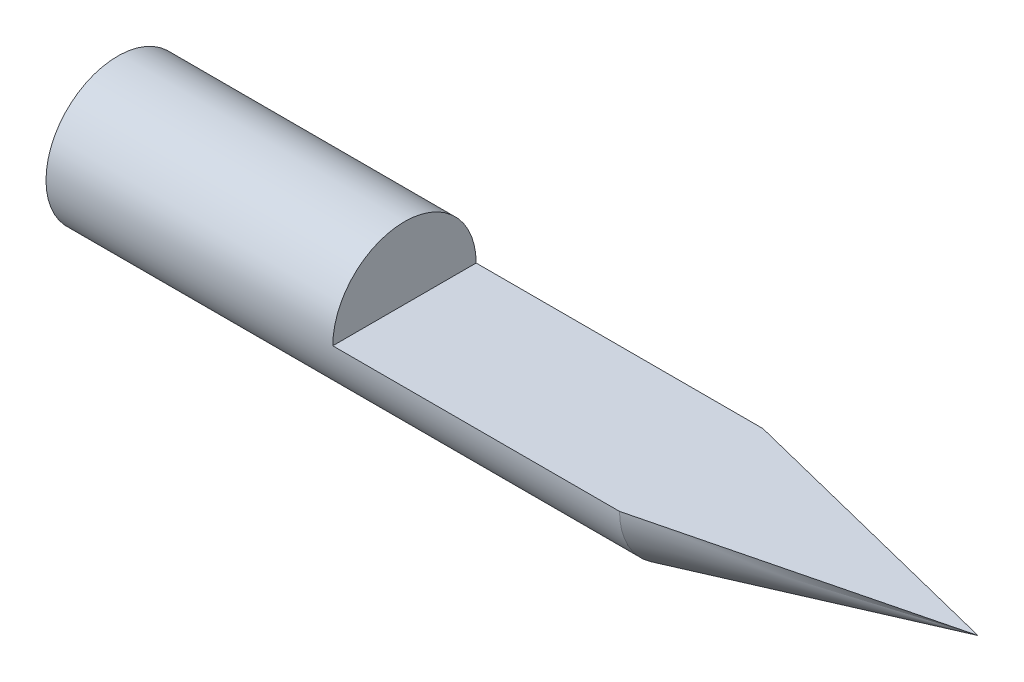
ISO-10303-21;
HEADER;
FILE_DESCRIPTION(('STEP AP214'),'2;1');
FILE_NAME('part.step','',(''),(''),'','','');
FILE_SCHEMA(('AUTOMOTIVE_DESIGN { 1 0 10303 214 1 1 1 1 }'));
ENDSEC;
DATA;
#1=APPLICATION_CONTEXT('core data for automotive mechanical design processes');
#2=APPLICATION_PROTOCOL_DEFINITION('international standard','automotive_design',2000,#1);
#3=PRODUCT_CONTEXT('',#1,'mechanical');
#4=PRODUCT('Part','Part','',(#3));
#5=PRODUCT_RELATED_PRODUCT_CATEGORY('part','',(#4));
#6=PRODUCT_DEFINITION_FORMATION('','',#4);
#7=PRODUCT_DEFINITION_CONTEXT('part definition',#1,'design');
#8=PRODUCT_DEFINITION('design','',#6,#7);
#9=PRODUCT_DEFINITION_SHAPE('','',#8);
#10=(LENGTH_UNIT() NAMED_UNIT(*) SI_UNIT(.MILLI.,.METRE.));
#11=(NAMED_UNIT(*) PLANE_ANGLE_UNIT() SI_UNIT($,.RADIAN.));
#12=(NAMED_UNIT(*) SI_UNIT($,.STERADIAN.) SOLID_ANGLE_UNIT());
#13=UNCERTAINTY_MEASURE_WITH_UNIT(LENGTH_MEASURE(1.E-05),#10,'distance_accuracy_value','');
#14=(GEOMETRIC_REPRESENTATION_CONTEXT(3) GLOBAL_UNCERTAINTY_ASSIGNED_CONTEXT((#13)) GLOBAL_UNIT_ASSIGNED_CONTEXT((#10,
#11,#12)) REPRESENTATION_CONTEXT('',''));
#15=CARTESIAN_POINT('',(0.,0.,0.));
#16=DIRECTION('',(0.,0.,1.));
#17=DIRECTION('',(1.,0.,0.));
#18=AXIS2_PLACEMENT_3D('',#15,#16,#17);
#19=CARTESIAN_POINT('',(-15.,1.25,0.));
#20=DIRECTION('',(1.,0.,0.));
#21=DIRECTION('',(0.,0.,-1.));
#22=AXIS2_PLACEMENT_3D('',#19,#20,#21);
#23=PLANE('',#22);
#24=CARTESIAN_POINT('',(-15.,-1.25,0.));
#25=DIRECTION('',(-1.,0.,0.));
#26=DIRECTION('',(0.,0.,1.));
#27=AXIS2_PLACEMENT_3D('',#24,#25,#26);
#28=CIRCLE('',#27,2.5);
#29=CARTESIAN_POINT('',(-15.,-1.25,2.5));
#30=VERTEX_POINT('',#29);
#31=EDGE_CURVE('E90',#30,#30,#28,.T.);
#32=ORIENTED_EDGE('',*,*,#31,.T.);
#33=EDGE_LOOP('',(#32));
#34=FACE_BOUND('',#33,.T.);
#35=ADVANCED_FACE('F38',(#34),#23,.F.);
#36=CARTESIAN_POINT('',(-15.,-1.25,0.));
#37=DIRECTION('',(-1.,0.,0.));
#38=DIRECTION('',(0.,0.,1.));
#39=AXIS2_PLACEMENT_3D('',#36,#37,#38);
#40=CYLINDRICAL_SURFACE('',#39,2.5);
#41=CARTESIAN_POINT('',(5.,-1.25,0.));
#42=DIRECTION('',(-1.,0.,0.));
#43=DIRECTION('',(0.,0.,1.));
#44=AXIS2_PLACEMENT_3D('',#41,#42,#43);
#45=CIRCLE('',#44,2.5);
#46=CARTESIAN_POINT('',(4.99999999999999,-1.25,-2.5));
#47=VERTEX_POINT('',#46);
#48=CARTESIAN_POINT('',(4.99999999999999,-1.25,2.5));
#49=VERTEX_POINT('',#48);
#50=EDGE_CURVE('E82',#47,#49,#45,.T.);
#51=ORIENTED_EDGE('',*,*,#50,.T.);
#52=DIRECTION('',(1.,0.,0.));
#53=VECTOR('',#52,1.);
#54=CARTESIAN_POINT('',(-5.,-1.25,2.5));
#55=LINE('',#54,#53);
#56=CARTESIAN_POINT('',(-5.,-1.25,2.5));
#57=VERTEX_POINT('',#56);
#58=EDGE_CURVE('E74',#57,#49,#55,.T.);
#59=ORIENTED_EDGE('',*,*,#58,.F.);
#60=CARTESIAN_POINT('',(-5.,-1.25,0.));
#61=DIRECTION('',(1.,0.,0.));
#62=DIRECTION('',(0.,0.,-1.));
#63=AXIS2_PLACEMENT_3D('',#60,#61,#62);
#64=CIRCLE('',#63,2.5);
#65=CARTESIAN_POINT('',(-5.,-1.25,-2.5));
#66=VERTEX_POINT('',#65);
#67=EDGE_CURVE('E65',#66,#57,#64,.T.);
#68=ORIENTED_EDGE('',*,*,#67,.F.);
#69=DIRECTION('',(1.,0.,0.));
#70=VECTOR('',#69,1.);
#71=CARTESIAN_POINT('',(-5.,-1.25,-2.5));
#72=LINE('',#71,#70);
#73=EDGE_CURVE('E75',#66,#47,#72,.T.);
#74=ORIENTED_EDGE('',*,*,#73,.T.);
#75=EDGE_LOOP('',(#51,#59,#68,#74));
#76=FACE_BOUND('',#75,.T.);
#77=ORIENTED_EDGE('',*,*,#31,.F.);
#78=EDGE_LOOP('',(#77));
#79=FACE_BOUND('',#78,.T.);
#80=ADVANCED_FACE('F79',(#76,#79),#40,.T.);
#81=CARTESIAN_POINT('',(15.,-1.25,0.));
#82=DIRECTION('',(-1.,0.,0.));
#83=DIRECTION('',(0.,0.,1.));
#84=AXIS2_PLACEMENT_3D('',#81,#82,#83);
#85=CONICAL_SURFACE('',#84,0.,0.244978663126864);
#86=DIRECTION('',(0.970142500145332,0.,0.242535625036333));
#87=VECTOR('',#86,1.);
#88=CARTESIAN_POINT('',(15.,-1.25,0.));
#89=LINE('',#88,#87);
#90=CARTESIAN_POINT('',(15.,-1.25,0.));
#91=VERTEX_POINT('',#90);
#92=EDGE_CURVE('E46',#47,#91,#89,.T.);
#93=ORIENTED_EDGE('',*,*,#92,.T.);
#94=DIRECTION('',(-0.970142500145332,0.,0.242535625036333));
#95=VECTOR('',#94,1.);
#96=CARTESIAN_POINT('',(15.,-1.25,0.));
#97=LINE('',#96,#95);
#98=EDGE_CURVE('E11',#91,#49,#97,.T.);
#99=ORIENTED_EDGE('',*,*,#98,.T.);
#100=ORIENTED_EDGE('',*,*,#50,.F.);
#101=EDGE_LOOP('',(#93,#99,#100));
#102=FACE_BOUND('',#101,.T.);
#103=ADVANCED_FACE('F95',(#102),#85,.T.);
#104=CARTESIAN_POINT('',(-5.,-1.25,2.5));
#105=DIRECTION('',(0.,-1.,0.));
#106=DIRECTION('',(0.,0.,-1.));
#107=AXIS2_PLACEMENT_3D('',#104,#105,#106);
#108=PLANE('',#107);
#109=ORIENTED_EDGE('',*,*,#92,.F.);
#110=ORIENTED_EDGE('',*,*,#73,.F.);
#111=DIRECTION('',(0.,0.,-1.));
#112=VECTOR('',#111,1.);
#113=CARTESIAN_POINT('',(-5.,-1.25,2.5));
#114=LINE('',#113,#112);
#115=EDGE_CURVE('E68',#57,#66,#114,.T.);
#116=ORIENTED_EDGE('',*,*,#115,.F.);
#117=ORIENTED_EDGE('',*,*,#58,.T.);
#118=ORIENTED_EDGE('',*,*,#98,.F.);
#119=EDGE_LOOP('',(#109,#110,#116,#117,#118));
#120=FACE_BOUND('',#119,.T.);
#121=ADVANCED_FACE('F73',(#120),#108,.F.);
#122=CARTESIAN_POINT('',(-5.,-1.25,0.));
#123=DIRECTION('',(1.,0.,0.));
#124=DIRECTION('',(0.,0.,-1.));
#125=AXIS2_PLACEMENT_3D('',#122,#123,#124);
#126=PLANE('',#125);
#127=ORIENTED_EDGE('',*,*,#67,.T.);
#128=ORIENTED_EDGE('',*,*,#115,.T.);
#129=EDGE_LOOP('',(#127,#128));
#130=FACE_BOUND('',#129,.T.);
#131=ADVANCED_FACE('F67',(#130),#126,.T.);
#132=CLOSED_SHELL('',(#35,#80,#103,#121,#131));
#133=MANIFOLD_SOLID_BREP('B2',#132);
#134=ADVANCED_BREP_SHAPE_REPRESENTATION('',(#18,#133),#14);
#135=SHAPE_DEFINITION_REPRESENTATION(#9,#134);
ENDSEC;
END-ISO-10303-21;
